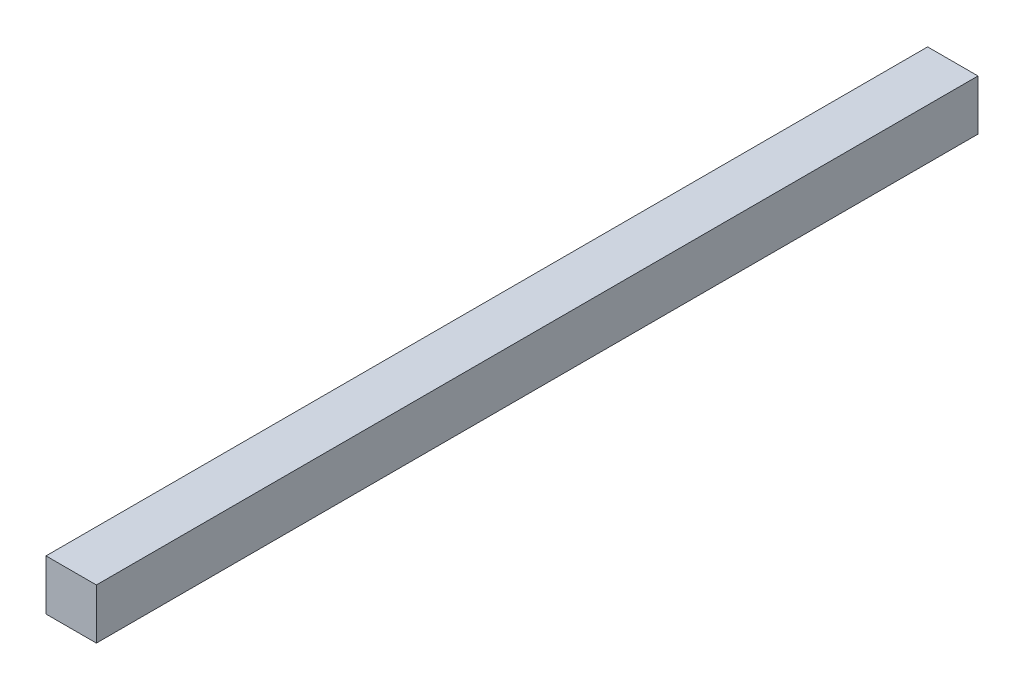
ISO-10303-21;
HEADER;
FILE_DESCRIPTION(('STEP AP214'),'2;1');
FILE_NAME('part.step','',(''),(''),'','','');
FILE_SCHEMA(('AUTOMOTIVE_DESIGN { 1 0 10303 214 1 1 1 1 }'));
ENDSEC;
DATA;
#1=APPLICATION_CONTEXT('core data for automotive mechanical design processes');
#2=APPLICATION_PROTOCOL_DEFINITION('international standard','automotive_design',2000,#1);
#3=PRODUCT_CONTEXT('',#1,'mechanical');
#4=PRODUCT('Part','Part','',(#3));
#5=PRODUCT_RELATED_PRODUCT_CATEGORY('part','',(#4));
#6=PRODUCT_DEFINITION_FORMATION('','',#4);
#7=PRODUCT_DEFINITION_CONTEXT('part definition',#1,'design');
#8=PRODUCT_DEFINITION('design','',#6,#7);
#9=PRODUCT_DEFINITION_SHAPE('','',#8);
#10=(LENGTH_UNIT() NAMED_UNIT(*) SI_UNIT(.MILLI.,.METRE.));
#11=(NAMED_UNIT(*) PLANE_ANGLE_UNIT() SI_UNIT($,.RADIAN.));
#12=(NAMED_UNIT(*) SI_UNIT($,.STERADIAN.) SOLID_ANGLE_UNIT());
#13=UNCERTAINTY_MEASURE_WITH_UNIT(LENGTH_MEASURE(1.E-05),#10,'distance_accuracy_value','');
#14=(GEOMETRIC_REPRESENTATION_CONTEXT(3) GLOBAL_UNCERTAINTY_ASSIGNED_CONTEXT((#13)) GLOBAL_UNIT_ASSIGNED_CONTEXT((#10,
#11,#12)) REPRESENTATION_CONTEXT('',''));
#15=CARTESIAN_POINT('',(0.,0.,0.));
#16=DIRECTION('',(0.,0.,1.));
#17=DIRECTION('',(1.,0.,0.));
#18=AXIS2_PLACEMENT_3D('',#15,#16,#17);
#19=CARTESIAN_POINT('',(0.,0.,-350.));
#20=DIRECTION('',(-1.,0.,0.));
#21=DIRECTION('',(0.,0.,1.));
#22=AXIS2_PLACEMENT_3D('',#19,#20,#21);
#23=PLANE('',#22);
#24=DIRECTION('',(0.,-1.,0.));
#25=VECTOR('',#24,1.);
#26=CARTESIAN_POINT('',(0.,0.,0.));
#27=LINE('',#26,#25);
#28=CARTESIAN_POINT('',(0.,20.,0.));
#29=VERTEX_POINT('',#28);
#30=CARTESIAN_POINT('',(0.,0.,0.));
#31=VERTEX_POINT('',#30);
#32=EDGE_CURVE('E97',#29,#31,#27,.T.);
#33=ORIENTED_EDGE('',*,*,#32,.F.);
#34=DIRECTION('',(0.,0.,1.));
#35=VECTOR('',#34,1.);
#36=CARTESIAN_POINT('',(0.,20.,-350.));
#37=LINE('',#36,#35);
#38=CARTESIAN_POINT('',(0.,20.,-350.));
#39=VERTEX_POINT('',#38);
#40=EDGE_CURVE('E11',#39,#29,#37,.T.);
#41=ORIENTED_EDGE('',*,*,#40,.F.);
#42=DIRECTION('',(0.,-1.,0.));
#43=VECTOR('',#42,1.);
#44=CARTESIAN_POINT('',(0.,0.,-350.));
#45=LINE('',#44,#43);
#46=CARTESIAN_POINT('',(0.,0.,-350.));
#47=VERTEX_POINT('',#46);
#48=EDGE_CURVE('E91',#39,#47,#45,.T.);
#49=ORIENTED_EDGE('',*,*,#48,.T.);
#50=DIRECTION('',(0.,0.,1.));
#51=VECTOR('',#50,1.);
#52=CARTESIAN_POINT('',(0.,0.,-350.));
#53=LINE('',#52,#51);
#54=EDGE_CURVE('E36',#47,#31,#53,.T.);
#55=ORIENTED_EDGE('',*,*,#54,.T.);
#56=EDGE_LOOP('',(#33,#41,#49,#55));
#57=FACE_BOUND('',#56,.T.);
#58=ADVANCED_FACE('F33',(#57),#23,.T.);
#59=CARTESIAN_POINT('',(0.,20.,-350.));
#60=DIRECTION('',(0.,1.,0.));
#61=DIRECTION('',(0.,0.,1.));
#62=AXIS2_PLACEMENT_3D('',#59,#60,#61);
#63=PLANE('',#62);
#64=DIRECTION('',(-1.,0.,0.));
#65=VECTOR('',#64,1.);
#66=CARTESIAN_POINT('',(0.,20.,0.));
#67=LINE('',#66,#65);
#68=CARTESIAN_POINT('',(20.,20.,0.));
#69=VERTEX_POINT('',#68);
#70=EDGE_CURVE('E93',#69,#29,#67,.T.);
#71=ORIENTED_EDGE('',*,*,#70,.F.);
#72=DIRECTION('',(0.,0.,1.));
#73=VECTOR('',#72,1.);
#74=CARTESIAN_POINT('',(20.,20.,-350.));
#75=LINE('',#74,#73);
#76=CARTESIAN_POINT('',(20.,20.,-350.));
#77=VERTEX_POINT('',#76);
#78=EDGE_CURVE('E42',#77,#69,#75,.T.);
#79=ORIENTED_EDGE('',*,*,#78,.F.);
#80=DIRECTION('',(-1.,0.,0.));
#81=VECTOR('',#80,1.);
#82=CARTESIAN_POINT('',(0.,20.,-350.));
#83=LINE('',#82,#81);
#84=EDGE_CURVE('E88',#77,#39,#83,.T.);
#85=ORIENTED_EDGE('',*,*,#84,.T.);
#86=ORIENTED_EDGE('',*,*,#40,.T.);
#87=EDGE_LOOP('',(#71,#79,#85,#86));
#88=FACE_BOUND('',#87,.T.);
#89=ADVANCED_FACE('F107',(#88),#63,.T.);
#90=CARTESIAN_POINT('',(20.,0.,-350.));
#91=DIRECTION('',(1.,0.,0.));
#92=DIRECTION('',(0.,0.,-1.));
#93=AXIS2_PLACEMENT_3D('',#90,#91,#92);
#94=PLANE('',#93);
#95=DIRECTION('',(0.,1.,0.));
#96=VECTOR('',#95,1.);
#97=CARTESIAN_POINT('',(20.,0.,0.));
#98=LINE('',#97,#96);
#99=CARTESIAN_POINT('',(20.,0.,0.));
#100=VERTEX_POINT('',#99);
#101=EDGE_CURVE('E83',#100,#69,#98,.T.);
#102=ORIENTED_EDGE('',*,*,#101,.F.);
#103=DIRECTION('',(0.,0.,1.));
#104=VECTOR('',#103,1.);
#105=CARTESIAN_POINT('',(20.,0.,-350.));
#106=LINE('',#105,#104);
#107=CARTESIAN_POINT('',(20.,0.,-350.));
#108=VERTEX_POINT('',#107);
#109=EDGE_CURVE('E78',#108,#100,#106,.T.);
#110=ORIENTED_EDGE('',*,*,#109,.F.);
#111=DIRECTION('',(0.,1.,0.));
#112=VECTOR('',#111,1.);
#113=CARTESIAN_POINT('',(20.,0.,-350.));
#114=LINE('',#113,#112);
#115=EDGE_CURVE('E81',#108,#77,#114,.T.);
#116=ORIENTED_EDGE('',*,*,#115,.T.);
#117=ORIENTED_EDGE('',*,*,#78,.T.);
#118=EDGE_LOOP('',(#102,#110,#116,#117));
#119=FACE_BOUND('',#118,.T.);
#120=ADVANCED_FACE('F80',(#119),#94,.T.);
#121=CARTESIAN_POINT('',(0.,0.,-350.));
#122=DIRECTION('',(0.,-1.,0.));
#123=DIRECTION('',(0.,0.,-1.));
#124=AXIS2_PLACEMENT_3D('',#121,#122,#123);
#125=PLANE('',#124);
#126=DIRECTION('',(1.,0.,0.));
#127=VECTOR('',#126,1.);
#128=CARTESIAN_POINT('',(0.,0.,0.));
#129=LINE('',#128,#127);
#130=EDGE_CURVE('E100',#31,#100,#129,.T.);
#131=ORIENTED_EDGE('',*,*,#130,.F.);
#132=ORIENTED_EDGE('',*,*,#54,.F.);
#133=DIRECTION('',(1.,0.,0.));
#134=VECTOR('',#133,1.);
#135=CARTESIAN_POINT('',(0.,0.,-350.));
#136=LINE('',#135,#134);
#137=EDGE_CURVE('E87',#47,#108,#136,.T.);
#138=ORIENTED_EDGE('',*,*,#137,.T.);
#139=ORIENTED_EDGE('',*,*,#109,.T.);
#140=EDGE_LOOP('',(#131,#132,#138,#139));
#141=FACE_BOUND('',#140,.T.);
#142=ADVANCED_FACE('F90',(#141),#125,.T.);
#143=CARTESIAN_POINT('',(0.,0.,-350.));
#144=DIRECTION('',(0.,0.,-1.));
#145=DIRECTION('',(-1.,0.,0.));
#146=AXIS2_PLACEMENT_3D('',#143,#144,#145);
#147=PLANE('',#146);
#148=ORIENTED_EDGE('',*,*,#48,.F.);
#149=ORIENTED_EDGE('',*,*,#84,.F.);
#150=ORIENTED_EDGE('',*,*,#115,.F.);
#151=ORIENTED_EDGE('',*,*,#137,.F.);
#152=EDGE_LOOP('',(#148,#149,#150,#151));
#153=FACE_BOUND('',#152,.T.);
#154=ADVANCED_FACE('F86',(#153),#147,.T.);
#155=CARTESIAN_POINT('',(0.,0.,0.));
#156=DIRECTION('',(0.,0.,-1.));
#157=DIRECTION('',(-1.,0.,0.));
#158=AXIS2_PLACEMENT_3D('',#155,#156,#157);
#159=PLANE('',#158);
#160=ORIENTED_EDGE('',*,*,#32,.T.);
#161=ORIENTED_EDGE('',*,*,#130,.T.);
#162=ORIENTED_EDGE('',*,*,#101,.T.);
#163=ORIENTED_EDGE('',*,*,#70,.T.);
#164=EDGE_LOOP('',(#160,#161,#162,#163));
#165=FACE_BOUND('',#164,.T.);
#166=ADVANCED_FACE('F106',(#165),#159,.F.);
#167=CLOSED_SHELL('',(#58,#89,#120,#142,#154,#166));
#168=MANIFOLD_SOLID_BREP('B2',#167);
#169=ADVANCED_BREP_SHAPE_REPRESENTATION('',(#18,#168),#14);
#170=SHAPE_DEFINITION_REPRESENTATION(#9,#169);
ENDSEC;
END-ISO-10303-21;
